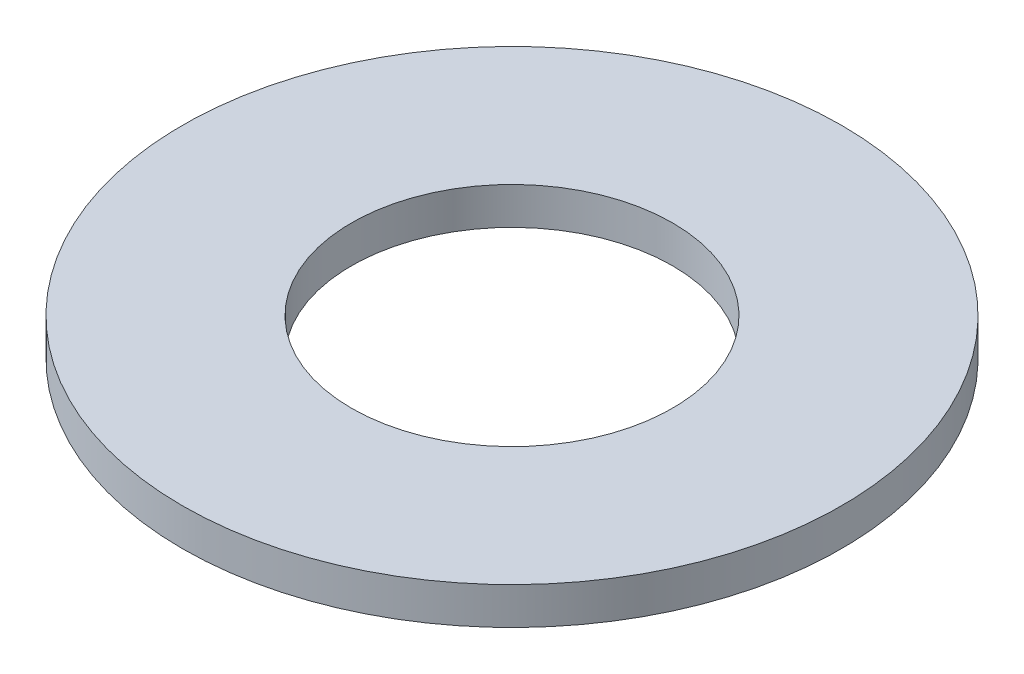
ISO-10303-21;
HEADER;
FILE_DESCRIPTION(('STEP AP214'),'2;1');
FILE_NAME('part.step','',(''),(''),'','','');
FILE_SCHEMA(('AUTOMOTIVE_DESIGN { 1 0 10303 214 1 1 1 1 }'));
ENDSEC;
DATA;
#1=APPLICATION_CONTEXT('core data for automotive mechanical design processes');
#2=APPLICATION_PROTOCOL_DEFINITION('international standard','automotive_design',2000,#1);
#3=PRODUCT_CONTEXT('',#1,'mechanical');
#4=PRODUCT('Part','Part','',(#3));
#5=PRODUCT_RELATED_PRODUCT_CATEGORY('part','',(#4));
#6=PRODUCT_DEFINITION_FORMATION('','',#4);
#7=PRODUCT_DEFINITION_CONTEXT('part definition',#1,'design');
#8=PRODUCT_DEFINITION('design','',#6,#7);
#9=PRODUCT_DEFINITION_SHAPE('','',#8);
#10=(LENGTH_UNIT() NAMED_UNIT(*) SI_UNIT(.MILLI.,.METRE.));
#11=(NAMED_UNIT(*) PLANE_ANGLE_UNIT() SI_UNIT($,.RADIAN.));
#12=(NAMED_UNIT(*) SI_UNIT($,.STERADIAN.) SOLID_ANGLE_UNIT());
#13=UNCERTAINTY_MEASURE_WITH_UNIT(LENGTH_MEASURE(1.E-05),#10,'distance_accuracy_value','');
#14=(GEOMETRIC_REPRESENTATION_CONTEXT(3) GLOBAL_UNCERTAINTY_ASSIGNED_CONTEXT((#13)) GLOBAL_UNIT_ASSIGNED_CONTEXT((#10,
#11,#12)) REPRESENTATION_CONTEXT('',''));
#15=CARTESIAN_POINT('',(0.,0.,0.));
#16=DIRECTION('',(0.,0.,1.));
#17=DIRECTION('',(1.,0.,0.));
#18=AXIS2_PLACEMENT_3D('',#15,#16,#17);
#19=CARTESIAN_POINT('',(0.,11.,0.));
#20=DIRECTION('',(0.,-1.,0.));
#21=DIRECTION('',(0.,0.,-1.));
#22=AXIS2_PLACEMENT_3D('',#19,#20,#21);
#23=CYLINDRICAL_SURFACE('',#22,97.5);
#24=CARTESIAN_POINT('',(0.,11.,0.));
#25=DIRECTION('',(0.,1.,0.));
#26=DIRECTION('',(0.,0.,1.));
#27=AXIS2_PLACEMENT_3D('',#24,#25,#26);
#28=CIRCLE('',#27,97.5);
#29=CARTESIAN_POINT('',(0.,11.,97.5));
#30=VERTEX_POINT('',#29);
#31=EDGE_CURVE('E10',#30,#30,#28,.T.);
#32=ORIENTED_EDGE('',*,*,#31,.F.);
#33=EDGE_LOOP('',(#32));
#34=FACE_BOUND('',#33,.T.);
#35=CARTESIAN_POINT('',(0.,0.,0.));
#36=DIRECTION('',(0.,1.,0.));
#37=DIRECTION('',(0.,0.,1.));
#38=AXIS2_PLACEMENT_3D('',#35,#36,#37);
#39=CIRCLE('',#38,97.5);
#40=CARTESIAN_POINT('',(0.,0.,97.5));
#41=VERTEX_POINT('',#40);
#42=EDGE_CURVE('E37',#41,#41,#39,.T.);
#43=ORIENTED_EDGE('',*,*,#42,.T.);
#44=EDGE_LOOP('',(#43));
#45=FACE_BOUND('',#44,.T.);
#46=ADVANCED_FACE('F40',(#34,#45),#23,.T.);
#47=CARTESIAN_POINT('',(0.,11.,0.));
#48=DIRECTION('',(0.,1.,0.));
#49=DIRECTION('',(0.,0.,1.));
#50=AXIS2_PLACEMENT_3D('',#47,#48,#49);
#51=PLANE('',#50);
#52=CARTESIAN_POINT('',(0.,11.,0.));
#53=DIRECTION('',(0.,1.,0.));
#54=DIRECTION('',(0.,0.,1.));
#55=AXIS2_PLACEMENT_3D('',#52,#53,#54);
#56=CIRCLE('',#55,47.5);
#57=CARTESIAN_POINT('',(0.,11.,47.5));
#58=VERTEX_POINT('',#57);
#59=EDGE_CURVE('E50',#58,#58,#56,.T.);
#60=ORIENTED_EDGE('',*,*,#59,.F.);
#61=EDGE_LOOP('',(#60));
#62=FACE_BOUND('',#61,.T.);
#63=ORIENTED_EDGE('',*,*,#31,.T.);
#64=EDGE_LOOP('',(#63));
#65=FACE_BOUND('',#64,.T.);
#66=ADVANCED_FACE('F59',(#62,#65),#51,.T.);
#67=CARTESIAN_POINT('',(0.,0.,0.));
#68=DIRECTION('',(0.,1.,0.));
#69=DIRECTION('',(0.,0.,1.));
#70=AXIS2_PLACEMENT_3D('',#67,#68,#69);
#71=PLANE('',#70);
#72=CARTESIAN_POINT('',(0.,0.,0.));
#73=DIRECTION('',(0.,1.,0.));
#74=DIRECTION('',(0.,0.,1.));
#75=AXIS2_PLACEMENT_3D('',#72,#73,#74);
#76=CIRCLE('',#75,47.5);
#77=CARTESIAN_POINT('',(0.,0.,47.5));
#78=VERTEX_POINT('',#77);
#79=EDGE_CURVE('E47',#78,#78,#76,.T.);
#80=ORIENTED_EDGE('',*,*,#79,.T.);
#81=EDGE_LOOP('',(#80));
#82=FACE_BOUND('',#81,.T.);
#83=ORIENTED_EDGE('',*,*,#42,.F.);
#84=EDGE_LOOP('',(#83));
#85=FACE_BOUND('',#84,.T.);
#86=ADVANCED_FACE('F58',(#82,#85),#71,.F.);
#87=CARTESIAN_POINT('',(0.,11.,0.));
#88=DIRECTION('',(0.,-1.,0.));
#89=DIRECTION('',(0.,0.,-1.));
#90=AXIS2_PLACEMENT_3D('',#87,#88,#89);
#91=CYLINDRICAL_SURFACE('',#90,47.5);
#92=ORIENTED_EDGE('',*,*,#59,.T.);
#93=EDGE_LOOP('',(#92));
#94=FACE_BOUND('',#93,.T.);
#95=ORIENTED_EDGE('',*,*,#79,.F.);
#96=EDGE_LOOP('',(#95));
#97=FACE_BOUND('',#96,.T.);
#98=ADVANCED_FACE('F54',(#94,#97),#91,.F.);
#99=CLOSED_SHELL('',(#46,#66,#86,#98));
#100=MANIFOLD_SOLID_BREP('B2',#99);
#101=ADVANCED_BREP_SHAPE_REPRESENTATION('',(#18,#100),#14);
#102=SHAPE_DEFINITION_REPRESENTATION(#9,#101);
ENDSEC;
END-ISO-10303-21;
